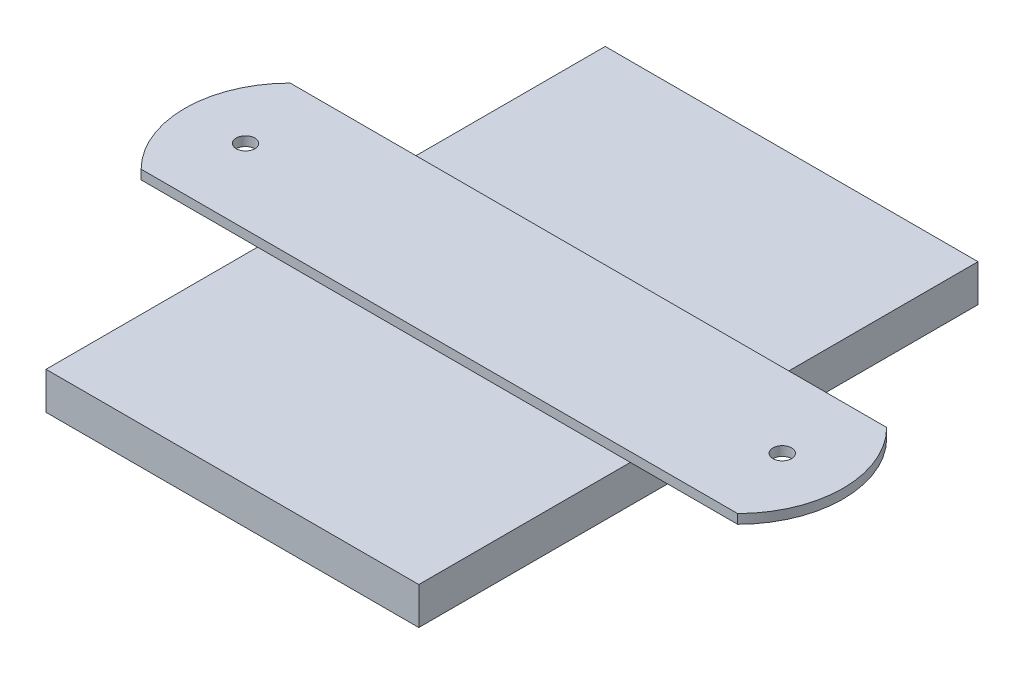
ISO-10303-21;
HEADER;
FILE_DESCRIPTION(('STEP AP214'),'2;1');
FILE_NAME('part.step','',(''),(''),'','','');
FILE_SCHEMA(('AUTOMOTIVE_DESIGN { 1 0 10303 214 1 1 1 1 }'));
ENDSEC;
DATA;
#1=APPLICATION_CONTEXT('core data for automotive mechanical design processes');
#2=APPLICATION_PROTOCOL_DEFINITION('international standard','automotive_design',2000,#1);
#3=PRODUCT_CONTEXT('',#1,'mechanical');
#4=PRODUCT('Part','Part','',(#3));
#5=PRODUCT_RELATED_PRODUCT_CATEGORY('part','',(#4));
#6=PRODUCT_DEFINITION_FORMATION('','',#4);
#7=PRODUCT_DEFINITION_CONTEXT('part definition',#1,'design');
#8=PRODUCT_DEFINITION('design','',#6,#7);
#9=PRODUCT_DEFINITION_SHAPE('','',#8);
#10=(LENGTH_UNIT() NAMED_UNIT(*) SI_UNIT(.MILLI.,.METRE.));
#11=(NAMED_UNIT(*) PLANE_ANGLE_UNIT() SI_UNIT($,.RADIAN.));
#12=(NAMED_UNIT(*) SI_UNIT($,.STERADIAN.) SOLID_ANGLE_UNIT());
#13=UNCERTAINTY_MEASURE_WITH_UNIT(LENGTH_MEASURE(1.E-05),#10,'distance_accuracy_value','');
#14=(GEOMETRIC_REPRESENTATION_CONTEXT(3) GLOBAL_UNCERTAINTY_ASSIGNED_CONTEXT((#13)) GLOBAL_UNIT_ASSIGNED_CONTEXT((#10,
#11,#12)) REPRESENTATION_CONTEXT('',''));
#15=CARTESIAN_POINT('',(0.,0.,0.));
#16=DIRECTION('',(0.,0.,1.));
#17=DIRECTION('',(1.,0.,0.));
#18=AXIS2_PLACEMENT_3D('',#15,#16,#17);
#19=CARTESIAN_POINT('',(0.,3.175,0.));
#20=DIRECTION('',(0.,-1.,0.));
#21=DIRECTION('',(0.,0.,-1.));
#22=AXIS2_PLACEMENT_3D('',#19,#20,#21);
#23=PLANE('',#22);
#24=DIRECTION('',(1.,0.,0.));
#25=VECTOR('',#24,1.);
#26=CARTESIAN_POINT('',(0.,3.175,-36.0324997064597));
#27=LINE('',#26,#25);
#28=CARTESIAN_POINT('',(0.,3.175,-36.0324997064597));
#29=VERTEX_POINT('',#28);
#30=CARTESIAN_POINT('',(63.5,3.175,-36.0324997064597));
#31=VERTEX_POINT('',#30);
#32=EDGE_CURVE('E44',#29,#31,#27,.T.);
#33=ORIENTED_EDGE('',*,*,#32,.F.);
#34=DIRECTION('',(0.,0.,1.));
#35=VECTOR('',#34,1.);
#36=CARTESIAN_POINT('',(0.,3.175,0.));
#37=LINE('',#36,#35);
#38=CARTESIAN_POINT('',(0.,3.175,0.));
#39=VERTEX_POINT('',#38);
#40=EDGE_CURVE('E174',#29,#39,#37,.T.);
#41=ORIENTED_EDGE('',*,*,#40,.T.);
#42=DIRECTION('',(1.,0.,0.));
#43=VECTOR('',#42,1.);
#44=CARTESIAN_POINT('',(0.,3.175,0.));
#45=LINE('',#44,#43);
#46=CARTESIAN_POINT('',(63.5,3.175,0.));
#47=VERTEX_POINT('',#46);
#48=EDGE_CURVE('E172',#39,#47,#45,.T.);
#49=ORIENTED_EDGE('',*,*,#48,.T.);
#50=DIRECTION('',(0.,0.,-1.));
#51=VECTOR('',#50,1.);
#52=CARTESIAN_POINT('',(63.5,3.175,0.));
#53=LINE('',#52,#51);
#54=EDGE_CURVE('E177',#47,#31,#53,.T.);
#55=ORIENTED_EDGE('',*,*,#54,.T.);
#56=EDGE_LOOP('',(#33,#41,#49,#55));
#57=FACE_BOUND('',#56,.T.);
#58=ADVANCED_FACE('F35',(#57),#23,.F.);
#59=CARTESIAN_POINT('',(0.,3.175,0.));
#60=DIRECTION('',(1.,0.,0.));
#61=DIRECTION('',(0.,0.,-1.));
#62=AXIS2_PLACEMENT_3D('',#59,#60,#61);
#63=PLANE('',#62);
#64=DIRECTION('',(0.,0.,1.));
#65=VECTOR('',#64,1.);
#66=CARTESIAN_POINT('',(0.,-3.175,0.));
#67=LINE('',#66,#65);
#68=CARTESIAN_POINT('',(0.,-3.175,-95.25));
#69=VERTEX_POINT('',#68);
#70=CARTESIAN_POINT('',(0.,-3.175,0.));
#71=VERTEX_POINT('',#70);
#72=EDGE_CURVE('E125',#69,#71,#67,.T.);
#73=ORIENTED_EDGE('',*,*,#72,.T.);
#74=DIRECTION('',(0.,-1.,0.));
#75=VECTOR('',#74,1.);
#76=CARTESIAN_POINT('',(0.,3.175,0.));
#77=LINE('',#76,#75);
#78=EDGE_CURVE('E39',#39,#71,#77,.T.);
#79=ORIENTED_EDGE('',*,*,#78,.F.);
#80=ORIENTED_EDGE('',*,*,#40,.F.);
#81=CARTESIAN_POINT('',(0.,3.175,-61.4324997064597));
#82=VERTEX_POINT('',#81);
#83=EDGE_CURVE('E173',#82,#29,#37,.T.);
#84=ORIENTED_EDGE('',*,*,#83,.F.);
#85=CARTESIAN_POINT('',(0.,3.175,-95.25));
#86=VERTEX_POINT('',#85);
#87=EDGE_CURVE('E170',#86,#82,#37,.T.);
#88=ORIENTED_EDGE('',*,*,#87,.F.);
#89=DIRECTION('',(0.,-1.,0.));
#90=VECTOR('',#89,1.);
#91=CARTESIAN_POINT('',(0.,3.175,-95.25));
#92=LINE('',#91,#90);
#93=EDGE_CURVE('E182',#86,#69,#92,.T.);
#94=ORIENTED_EDGE('',*,*,#93,.T.);
#95=EDGE_LOOP('',(#73,#79,#80,#84,#88,#94));
#96=FACE_BOUND('',#95,.T.);
#97=ADVANCED_FACE('F37',(#96),#63,.F.);
#98=CARTESIAN_POINT('',(0.,3.175,0.));
#99=DIRECTION('',(0.,0.,-1.));
#100=DIRECTION('',(-1.,0.,0.));
#101=AXIS2_PLACEMENT_3D('',#98,#99,#100);
#102=PLANE('',#101);
#103=DIRECTION('',(1.,0.,0.));
#104=VECTOR('',#103,1.);
#105=CARTESIAN_POINT('',(0.,-3.175,0.));
#106=LINE('',#105,#104);
#107=CARTESIAN_POINT('',(63.5,-3.175,0.));
#108=VERTEX_POINT('',#107);
#109=EDGE_CURVE('E185',#71,#108,#106,.T.);
#110=ORIENTED_EDGE('',*,*,#109,.T.);
#111=DIRECTION('',(0.,-1.,0.));
#112=VECTOR('',#111,1.);
#113=CARTESIAN_POINT('',(63.5,3.175,0.));
#114=LINE('',#113,#112);
#115=EDGE_CURVE('E195',#47,#108,#114,.T.);
#116=ORIENTED_EDGE('',*,*,#115,.F.);
#117=ORIENTED_EDGE('',*,*,#48,.F.);
#118=ORIENTED_EDGE('',*,*,#78,.T.);
#119=EDGE_LOOP('',(#110,#116,#117,#118));
#120=FACE_BOUND('',#119,.T.);
#121=ADVANCED_FACE('F223',(#120),#102,.F.);
#122=CARTESIAN_POINT('',(63.5,3.175,0.));
#123=DIRECTION('',(-1.,0.,0.));
#124=DIRECTION('',(0.,0.,1.));
#125=AXIS2_PLACEMENT_3D('',#122,#123,#124);
#126=PLANE('',#125);
#127=DIRECTION('',(0.,0.,-1.));
#128=VECTOR('',#127,1.);
#129=CARTESIAN_POINT('',(63.5,-3.175,0.));
#130=LINE('',#129,#128);
#131=CARTESIAN_POINT('',(63.5,-3.175,-95.25));
#132=VERTEX_POINT('',#131);
#133=EDGE_CURVE('E187',#108,#132,#130,.T.);
#134=ORIENTED_EDGE('',*,*,#133,.T.);
#135=DIRECTION('',(0.,-1.,0.));
#136=VECTOR('',#135,1.);
#137=CARTESIAN_POINT('',(63.5,3.175,-95.25));
#138=LINE('',#137,#136);
#139=CARTESIAN_POINT('',(63.5,3.175,-95.25));
#140=VERTEX_POINT('',#139);
#141=EDGE_CURVE('E193',#140,#132,#138,.T.);
#142=ORIENTED_EDGE('',*,*,#141,.F.);
#143=CARTESIAN_POINT('',(63.5,3.175,-61.4324997064597));
#144=VERTEX_POINT('',#143);
#145=EDGE_CURVE('E176',#144,#140,#53,.T.);
#146=ORIENTED_EDGE('',*,*,#145,.F.);
#147=EDGE_CURVE('E180',#31,#144,#53,.T.);
#148=ORIENTED_EDGE('',*,*,#147,.F.);
#149=ORIENTED_EDGE('',*,*,#54,.F.);
#150=ORIENTED_EDGE('',*,*,#115,.T.);
#151=EDGE_LOOP('',(#134,#142,#146,#148,#149,#150));
#152=FACE_BOUND('',#151,.T.);
#153=ADVANCED_FACE('F230',(#152),#126,.F.);
#154=CARTESIAN_POINT('',(0.,3.175,-95.25));
#155=DIRECTION('',(0.,0.,1.));
#156=DIRECTION('',(1.,0.,0.));
#157=AXIS2_PLACEMENT_3D('',#154,#155,#156);
#158=PLANE('',#157);
#159=DIRECTION('',(-1.,0.,0.));
#160=VECTOR('',#159,1.);
#161=CARTESIAN_POINT('',(0.,-3.175,-95.25));
#162=LINE('',#161,#160);
#163=EDGE_CURVE('E189',#132,#69,#162,.T.);
#164=ORIENTED_EDGE('',*,*,#163,.T.);
#165=ORIENTED_EDGE('',*,*,#93,.F.);
#166=DIRECTION('',(-1.,0.,0.));
#167=VECTOR('',#166,1.);
#168=CARTESIAN_POINT('',(0.,3.175,-95.25));
#169=LINE('',#168,#167);
#170=EDGE_CURVE('E179',#140,#86,#169,.T.);
#171=ORIENTED_EDGE('',*,*,#170,.F.);
#172=ORIENTED_EDGE('',*,*,#141,.T.);
#173=EDGE_LOOP('',(#164,#165,#171,#172));
#174=FACE_BOUND('',#173,.T.);
#175=ADVANCED_FACE('F233',(#174),#158,.F.);
#176=ORIENTED_EDGE('',*,*,#87,.T.);
#177=DIRECTION('',(1.,0.,0.));
#178=VECTOR('',#177,1.);
#179=CARTESIAN_POINT('',(0.,3.175,-61.4324997064597));
#180=LINE('',#179,#178);
#181=EDGE_CURVE('E11',#82,#144,#180,.T.);
#182=ORIENTED_EDGE('',*,*,#181,.T.);
#183=ORIENTED_EDGE('',*,*,#145,.T.);
#184=ORIENTED_EDGE('',*,*,#170,.T.);
#185=EDGE_LOOP('',(#176,#182,#183,#184));
#186=FACE_BOUND('',#185,.T.);
#187=ADVANCED_FACE('F234',(#186),#23,.F.);
#188=CARTESIAN_POINT('',(0.,-3.175,0.));
#189=DIRECTION('',(0.,-1.,0.));
#190=DIRECTION('',(0.,0.,-1.));
#191=AXIS2_PLACEMENT_3D('',#188,#189,#190);
#192=PLANE('',#191);
#193=ORIENTED_EDGE('',*,*,#72,.F.);
#194=ORIENTED_EDGE('',*,*,#163,.F.);
#195=ORIENTED_EDGE('',*,*,#133,.F.);
#196=ORIENTED_EDGE('',*,*,#109,.F.);
#197=EDGE_LOOP('',(#193,#194,#195,#196));
#198=FACE_BOUND('',#197,.T.);
#199=ADVANCED_FACE('F228',(#198),#192,.T.);
#200=CARTESIAN_POINT('',(0.,3.175,0.));
#201=DIRECTION('',(0.,1.,0.));
#202=DIRECTION('',(0.,0.,1.));
#203=AXIS2_PLACEMENT_3D('',#200,#201,#202);
#204=PLANE('',#203);
#205=CARTESIAN_POINT('',(-14.7436617562433,3.175,-48.7324997064597));
#206=DIRECTION('',(0.,1.,0.));
#207=DIRECTION('',(0.,0.,1.));
#208=AXIS2_PLACEMENT_3D('',#205,#206,#207);
#209=CIRCLE('',#208,1.5875);
#210=CARTESIAN_POINT('',(-14.7436617562433,3.175,-47.1449997064597));
#211=VERTEX_POINT('',#210);
#212=EDGE_CURVE('E135',#211,#211,#209,.T.);
#213=ORIENTED_EDGE('',*,*,#212,.T.);
#214=EDGE_LOOP('',(#213));
#215=FACE_BOUND('',#214,.T.);
#216=CARTESIAN_POINT('',(-19.8313849137689,3.175,-61.4324997064597));
#217=VERTEX_POINT('',#216);
#218=EDGE_CURVE('E46',#217,#82,#180,.T.);
#219=ORIENTED_EDGE('',*,*,#218,.T.);
#220=ORIENTED_EDGE('',*,*,#83,.T.);
#221=CARTESIAN_POINT('',(-19.8313849137689,3.175,-36.0324997064597));
#222=VERTEX_POINT('',#221);
#223=EDGE_CURVE('E154',#222,#29,#27,.T.);
#224=ORIENTED_EDGE('',*,*,#223,.F.);
#225=CARTESIAN_POINT('',(-7.13138491376886,3.175,-48.7324997064597));
#226=DIRECTION('',(0.,1.,0.));
#227=DIRECTION('',(0.,0.,1.));
#228=AXIS2_PLACEMENT_3D('',#225,#226,#227);
#229=CIRCLE('',#228,17.9605122421383);
#230=EDGE_CURVE('E151',#222,#217,#229,.F.);
#231=ORIENTED_EDGE('',*,*,#230,.T.);
#232=EDGE_LOOP('',(#219,#220,#224,#231));
#233=FACE_BOUND('',#232,.T.);
#234=ADVANCED_FACE('F219',(#215,#233),#204,.F.);
#235=CARTESIAN_POINT('',(76.6808919287056,3.175,-48.7324997064597));
#236=DIRECTION('',(0.,1.,0.));
#237=DIRECTION('',(0.,0.,1.));
#238=AXIS2_PLACEMENT_3D('',#235,#236,#237);
#239=CIRCLE('',#238,1.5875);
#240=CARTESIAN_POINT('',(76.6808919287056,3.175,-47.1449997064597));
#241=VERTEX_POINT('',#240);
#242=EDGE_CURVE('E160',#241,#241,#239,.F.);
#243=ORIENTED_EDGE('',*,*,#242,.F.);
#244=EDGE_LOOP('',(#243));
#245=FACE_BOUND('',#244,.T.);
#246=CARTESIAN_POINT('',(81.7686150862311,3.175,-36.0324997064597));
#247=VERTEX_POINT('',#246);
#248=EDGE_CURVE('E153',#31,#247,#27,.T.);
#249=ORIENTED_EDGE('',*,*,#248,.F.);
#250=ORIENTED_EDGE('',*,*,#147,.T.);
#251=CARTESIAN_POINT('',(81.7686150862311,3.175,-61.4324997064597));
#252=VERTEX_POINT('',#251);
#253=EDGE_CURVE('E47',#144,#252,#180,.T.);
#254=ORIENTED_EDGE('',*,*,#253,.T.);
#255=CARTESIAN_POINT('',(69.0686150862311,3.175,-48.7324997064597));
#256=DIRECTION('',(0.,1.,0.));
#257=DIRECTION('',(0.,0.,1.));
#258=AXIS2_PLACEMENT_3D('',#255,#256,#257);
#259=CIRCLE('',#258,17.9605122421383);
#260=EDGE_CURVE('E157',#252,#247,#259,.F.);
#261=ORIENTED_EDGE('',*,*,#260,.T.);
#262=EDGE_LOOP('',(#249,#250,#254,#261));
#263=FACE_BOUND('',#262,.T.);
#264=ADVANCED_FACE('F214',(#245,#263),#204,.F.);
#265=CARTESIAN_POINT('',(0.,4.7625,-61.4324997064597));
#266=DIRECTION('',(0.,0.,-1.));
#267=DIRECTION('',(-1.,0.,0.));
#268=AXIS2_PLACEMENT_3D('',#265,#266,#267);
#269=PLANE('',#268);
#270=ORIENTED_EDGE('',*,*,#218,.F.);
#271=DIRECTION('',(0.,-1.,0.));
#272=VECTOR('',#271,1.);
#273=CARTESIAN_POINT('',(-19.8313849137689,4.7625,-61.4324997064597));
#274=LINE('',#273,#272);
#275=CARTESIAN_POINT('',(-19.8313849137689,4.7625,-61.4324997064597));
#276=VERTEX_POINT('',#275);
#277=EDGE_CURVE('E114',#276,#217,#274,.T.);
#278=ORIENTED_EDGE('',*,*,#277,.F.);
#279=DIRECTION('',(1.,0.,0.));
#280=VECTOR('',#279,1.);
#281=CARTESIAN_POINT('',(0.,4.7625,-61.4324997064597));
#282=LINE('',#281,#280);
#283=CARTESIAN_POINT('',(81.7686150862311,4.7625,-61.4324997064597));
#284=VERTEX_POINT('',#283);
#285=EDGE_CURVE('E118',#276,#284,#282,.T.);
#286=ORIENTED_EDGE('',*,*,#285,.T.);
#287=DIRECTION('',(0.,-1.,0.));
#288=VECTOR('',#287,1.);
#289=CARTESIAN_POINT('',(81.7686150862311,4.7625,-61.4324997064597));
#290=LINE('',#289,#288);
#291=EDGE_CURVE('E149',#284,#252,#290,.T.);
#292=ORIENTED_EDGE('',*,*,#291,.T.);
#293=ORIENTED_EDGE('',*,*,#253,.F.);
#294=ORIENTED_EDGE('',*,*,#181,.F.);
#295=EDGE_LOOP('',(#270,#278,#286,#292,#293,#294));
#296=FACE_BOUND('',#295,.T.);
#297=ADVANCED_FACE('F116',(#296),#269,.T.);
#298=CARTESIAN_POINT('',(-7.13138491376886,4.7625,-48.7324997064597));
#299=DIRECTION('',(0.,-1.,0.));
#300=DIRECTION('',(0.,0.,-1.));
#301=AXIS2_PLACEMENT_3D('',#298,#299,#300);
#302=CYLINDRICAL_SURFACE('',#301,17.9605122421383);
#303=ORIENTED_EDGE('',*,*,#230,.F.);
#304=DIRECTION('',(0.,-1.,0.));
#305=VECTOR('',#304,1.);
#306=CARTESIAN_POINT('',(-19.8313849137689,4.7625,-36.0324997064597));
#307=LINE('',#306,#305);
#308=CARTESIAN_POINT('',(-19.8313849137689,4.7625,-36.0324997064597));
#309=VERTEX_POINT('',#308);
#310=EDGE_CURVE('E126',#309,#222,#307,.T.);
#311=ORIENTED_EDGE('',*,*,#310,.F.);
#312=CARTESIAN_POINT('',(-7.13138491376886,4.7625,-48.7324997064597));
#313=DIRECTION('',(0.,1.,0.));
#314=DIRECTION('',(0.,0.,1.));
#315=AXIS2_PLACEMENT_3D('',#312,#313,#314);
#316=CIRCLE('',#315,17.9605122421383);
#317=EDGE_CURVE('E132',#309,#276,#316,.F.);
#318=ORIENTED_EDGE('',*,*,#317,.T.);
#319=ORIENTED_EDGE('',*,*,#277,.T.);
#320=EDGE_LOOP('',(#303,#311,#318,#319));
#321=FACE_BOUND('',#320,.T.);
#322=ADVANCED_FACE('F137',(#321),#302,.T.);
#323=CARTESIAN_POINT('',(0.,4.7625,-36.0324997064597));
#324=DIRECTION('',(0.,0.,-1.));
#325=DIRECTION('',(-1.,0.,0.));
#326=AXIS2_PLACEMENT_3D('',#323,#324,#325);
#327=PLANE('',#326);
#328=ORIENTED_EDGE('',*,*,#223,.T.);
#329=ORIENTED_EDGE('',*,*,#32,.T.);
#330=ORIENTED_EDGE('',*,*,#248,.T.);
#331=DIRECTION('',(0.,-1.,0.));
#332=VECTOR('',#331,1.);
#333=CARTESIAN_POINT('',(81.7686150862311,4.7625,-36.0324997064597));
#334=LINE('',#333,#332);
#335=CARTESIAN_POINT('',(81.7686150862311,4.7625,-36.0324997064597));
#336=VERTEX_POINT('',#335);
#337=EDGE_CURVE('E166',#336,#247,#334,.T.);
#338=ORIENTED_EDGE('',*,*,#337,.F.);
#339=DIRECTION('',(1.,0.,0.));
#340=VECTOR('',#339,1.);
#341=CARTESIAN_POINT('',(0.,4.7625,-36.0324997064597));
#342=LINE('',#341,#340);
#343=EDGE_CURVE('E139',#309,#336,#342,.T.);
#344=ORIENTED_EDGE('',*,*,#343,.F.);
#345=ORIENTED_EDGE('',*,*,#310,.T.);
#346=EDGE_LOOP('',(#328,#329,#330,#338,#344,#345));
#347=FACE_BOUND('',#346,.T.);
#348=ADVANCED_FACE('F208',(#347),#327,.F.);
#349=CARTESIAN_POINT('',(76.6808919287056,4.7625,-48.7324997064597));
#350=DIRECTION('',(0.,-1.,0.));
#351=DIRECTION('',(0.,0.,-1.));
#352=AXIS2_PLACEMENT_3D('',#349,#350,#351);
#353=CYLINDRICAL_SURFACE('',#352,1.5875);
#354=CARTESIAN_POINT('',(76.6808919287056,4.7625,-48.7324997064597));
#355=DIRECTION('',(0.,1.,0.));
#356=DIRECTION('',(0.,0.,1.));
#357=AXIS2_PLACEMENT_3D('',#354,#355,#356);
#358=CIRCLE('',#357,1.5875);
#359=CARTESIAN_POINT('',(76.6808919287056,4.7625,-47.1449997064597));
#360=VERTEX_POINT('',#359);
#361=EDGE_CURVE('E144',#360,#360,#358,.F.);
#362=ORIENTED_EDGE('',*,*,#361,.F.);
#363=EDGE_LOOP('',(#362));
#364=FACE_BOUND('',#363,.T.);
#365=ORIENTED_EDGE('',*,*,#242,.T.);
#366=EDGE_LOOP('',(#365));
#367=FACE_BOUND('',#366,.T.);
#368=ADVANCED_FACE('F344',(#364,#367),#353,.F.);
#369=CARTESIAN_POINT('',(69.0686150862311,4.7625,-48.7324997064597));
#370=DIRECTION('',(0.,-1.,0.));
#371=DIRECTION('',(0.,0.,-1.));
#372=AXIS2_PLACEMENT_3D('',#369,#370,#371);
#373=CYLINDRICAL_SURFACE('',#372,17.9605122421383);
#374=ORIENTED_EDGE('',*,*,#260,.F.);
#375=ORIENTED_EDGE('',*,*,#291,.F.);
#376=CARTESIAN_POINT('',(69.0686150862311,4.7625,-48.7324997064597));
#377=DIRECTION('',(0.,1.,0.));
#378=DIRECTION('',(0.,0.,1.));
#379=AXIS2_PLACEMENT_3D('',#376,#377,#378);
#380=CIRCLE('',#379,17.9605122421383);
#381=EDGE_CURVE('E134',#284,#336,#380,.F.);
#382=ORIENTED_EDGE('',*,*,#381,.T.);
#383=ORIENTED_EDGE('',*,*,#337,.T.);
#384=EDGE_LOOP('',(#374,#375,#382,#383));
#385=FACE_BOUND('',#384,.T.);
#386=ADVANCED_FACE('F213',(#385),#373,.T.);
#387=CARTESIAN_POINT('',(-14.7436617562433,4.7625,-48.7324997064597));
#388=DIRECTION('',(0.,-1.,0.));
#389=DIRECTION('',(0.,0.,-1.));
#390=AXIS2_PLACEMENT_3D('',#387,#388,#389);
#391=CYLINDRICAL_SURFACE('',#390,1.5875);
#392=CARTESIAN_POINT('',(-14.7436617562433,4.7625,-48.7324997064597));
#393=DIRECTION('',(0.,1.,0.));
#394=DIRECTION('',(0.,0.,1.));
#395=AXIS2_PLACEMENT_3D('',#392,#393,#394);
#396=CIRCLE('',#395,1.5875);
#397=CARTESIAN_POINT('',(-14.7436617562433,4.7625,-47.1449997064597));
#398=VERTEX_POINT('',#397);
#399=EDGE_CURVE('E147',#398,#398,#396,.T.);
#400=ORIENTED_EDGE('',*,*,#399,.T.);
#401=EDGE_LOOP('',(#400));
#402=FACE_BOUND('',#401,.T.);
#403=ORIENTED_EDGE('',*,*,#212,.F.);
#404=EDGE_LOOP('',(#403));
#405=FACE_BOUND('',#404,.T.);
#406=ADVANCED_FACE('F360',(#402,#405),#391,.F.);
#407=CARTESIAN_POINT('',(0.,4.7625,0.));
#408=DIRECTION('',(0.,1.,0.));
#409=DIRECTION('',(0.,0.,1.));
#410=AXIS2_PLACEMENT_3D('',#407,#408,#409);
#411=PLANE('',#410);
#412=ORIENTED_EDGE('',*,*,#285,.F.);
#413=ORIENTED_EDGE('',*,*,#317,.F.);
#414=ORIENTED_EDGE('',*,*,#343,.T.);
#415=ORIENTED_EDGE('',*,*,#381,.F.);
#416=EDGE_LOOP('',(#412,#413,#414,#415));
#417=FACE_BOUND('',#416,.T.);
#418=ORIENTED_EDGE('',*,*,#361,.T.);
#419=EDGE_LOOP('',(#418));
#420=FACE_BOUND('',#419,.T.);
#421=ORIENTED_EDGE('',*,*,#399,.F.);
#422=EDGE_LOOP('',(#421));
#423=FACE_BOUND('',#422,.T.);
#424=ADVANCED_FACE('F130',(#417,#420,#423),#411,.T.);
#425=CLOSED_SHELL('',(#58,#97,#121,#153,#175,#187,#199,#234,#264,#297,#322,#348,#368,#386,#406,#424));
#426=MANIFOLD_SOLID_BREP('B2',#425);
#427=ADVANCED_BREP_SHAPE_REPRESENTATION('',(#18,#426),#14);
#428=SHAPE_DEFINITION_REPRESENTATION(#9,#427);
ENDSEC;
END-ISO-10303-21;
